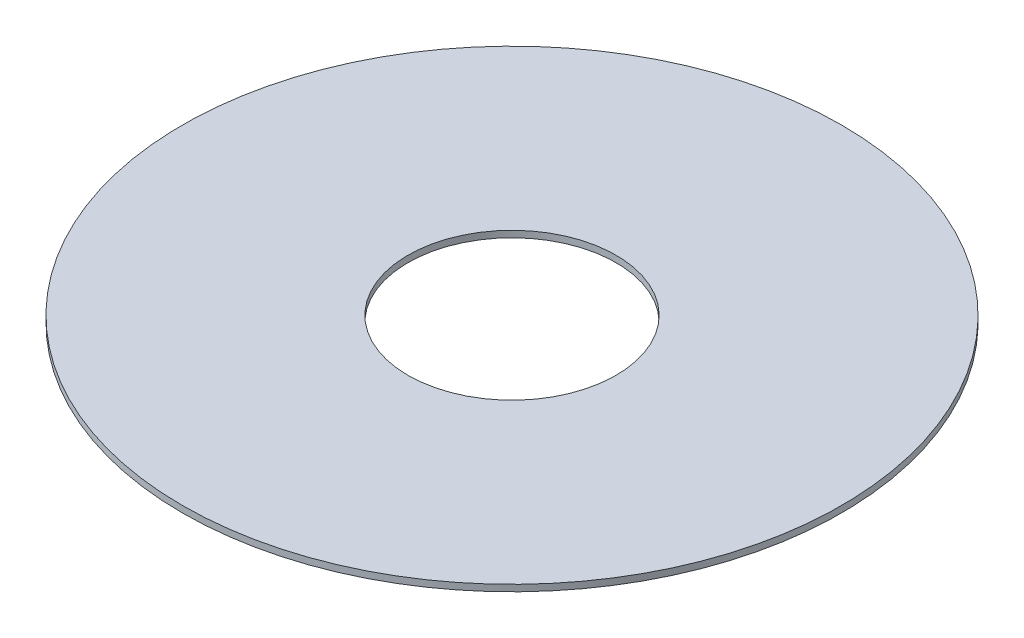
ISO-10303-21;
HEADER;
FILE_DESCRIPTION(('STEP AP214'),'2;1');
FILE_NAME('part.step','',(''),(''),'','','');
FILE_SCHEMA(('AUTOMOTIVE_DESIGN { 1 0 10303 214 1 1 1 1 }'));
ENDSEC;
DATA;
#1=APPLICATION_CONTEXT('core data for automotive mechanical design processes');
#2=APPLICATION_PROTOCOL_DEFINITION('international standard','automotive_design',2000,#1);
#3=PRODUCT_CONTEXT('',#1,'mechanical');
#4=PRODUCT('Part','Part','',(#3));
#5=PRODUCT_RELATED_PRODUCT_CATEGORY('part','',(#4));
#6=PRODUCT_DEFINITION_FORMATION('','',#4);
#7=PRODUCT_DEFINITION_CONTEXT('part definition',#1,'design');
#8=PRODUCT_DEFINITION('design','',#6,#7);
#9=PRODUCT_DEFINITION_SHAPE('','',#8);
#10=(LENGTH_UNIT() NAMED_UNIT(*) SI_UNIT(.MILLI.,.METRE.));
#11=(NAMED_UNIT(*) PLANE_ANGLE_UNIT() SI_UNIT($,.RADIAN.));
#12=(NAMED_UNIT(*) SI_UNIT($,.STERADIAN.) SOLID_ANGLE_UNIT());
#13=UNCERTAINTY_MEASURE_WITH_UNIT(LENGTH_MEASURE(1.E-05),#10,'distance_accuracy_value','');
#14=(GEOMETRIC_REPRESENTATION_CONTEXT(3) GLOBAL_UNCERTAINTY_ASSIGNED_CONTEXT((#13)) GLOBAL_UNIT_ASSIGNED_CONTEXT((#10,
#11,#12)) REPRESENTATION_CONTEXT('',''));
#15=CARTESIAN_POINT('',(0.,0.,0.));
#16=DIRECTION('',(0.,0.,1.));
#17=DIRECTION('',(1.,0.,0.));
#18=AXIS2_PLACEMENT_3D('',#15,#16,#17);
#19=CARTESIAN_POINT('',(0.,4.7625,0.));
#20=DIRECTION('',(0.,1.,0.));
#21=DIRECTION('',(0.,0.,1.));
#22=AXIS2_PLACEMENT_3D('',#19,#20,#21);
#23=PLANE('',#22);
#24=CARTESIAN_POINT('',(0.,4.7625,0.));
#25=DIRECTION('',(0.,1.,0.));
#26=DIRECTION('',(0.,0.,1.));
#27=AXIS2_PLACEMENT_3D('',#24,#25,#26);
#28=CIRCLE('',#27,241.3);
#29=CARTESIAN_POINT('',(0.,4.7625,241.3));
#30=VERTEX_POINT('',#29);
#31=EDGE_CURVE('E10',#30,#30,#28,.T.);
#32=ORIENTED_EDGE('',*,*,#31,.T.);
#33=EDGE_LOOP('',(#32));
#34=FACE_BOUND('',#33,.T.);
#35=CARTESIAN_POINT('',(0.,4.7625,0.));
#36=DIRECTION('',(0.,1.,0.));
#37=DIRECTION('',(0.,0.,1.));
#38=AXIS2_PLACEMENT_3D('',#35,#36,#37);
#39=CIRCLE('',#38,76.2);
#40=CARTESIAN_POINT('',(0.,4.7625,76.2));
#41=VERTEX_POINT('',#40);
#42=EDGE_CURVE('E39',#41,#41,#39,.T.);
#43=ORIENTED_EDGE('',*,*,#42,.F.);
#44=EDGE_LOOP('',(#43));
#45=FACE_BOUND('',#44,.T.);
#46=ADVANCED_FACE('F28',(#34,#45),#23,.T.);
#47=CARTESIAN_POINT('',(0.,0.,0.));
#48=DIRECTION('',(0.,1.,0.));
#49=DIRECTION('',(0.,0.,1.));
#50=AXIS2_PLACEMENT_3D('',#47,#48,#49);
#51=PLANE('',#50);
#52=CARTESIAN_POINT('',(0.,0.,0.));
#53=DIRECTION('',(0.,1.,0.));
#54=DIRECTION('',(0.,0.,1.));
#55=AXIS2_PLACEMENT_3D('',#52,#53,#54);
#56=CIRCLE('',#55,241.3);
#57=CARTESIAN_POINT('',(0.,0.,241.3));
#58=VERTEX_POINT('',#57);
#59=EDGE_CURVE('E32',#58,#58,#56,.T.);
#60=ORIENTED_EDGE('',*,*,#59,.F.);
#61=EDGE_LOOP('',(#60));
#62=FACE_BOUND('',#61,.T.);
#63=CARTESIAN_POINT('',(0.,0.,0.));
#64=DIRECTION('',(0.,1.,0.));
#65=DIRECTION('',(0.,0.,1.));
#66=AXIS2_PLACEMENT_3D('',#63,#64,#65);
#67=CIRCLE('',#66,76.2);
#68=CARTESIAN_POINT('',(0.,0.,76.2));
#69=VERTEX_POINT('',#68);
#70=EDGE_CURVE('E41',#69,#69,#67,.T.);
#71=ORIENTED_EDGE('',*,*,#70,.T.);
#72=EDGE_LOOP('',(#71));
#73=FACE_BOUND('',#72,.T.);
#74=ADVANCED_FACE('F51',(#62,#73),#51,.F.);
#75=CARTESIAN_POINT('',(0.,4.7625,0.));
#76=DIRECTION('',(0.,-1.,0.));
#77=DIRECTION('',(0.,0.,-1.));
#78=AXIS2_PLACEMENT_3D('',#75,#76,#77);
#79=CYLINDRICAL_SURFACE('',#78,241.3);
#80=ORIENTED_EDGE('',*,*,#31,.F.);
#81=EDGE_LOOP('',(#80));
#82=FACE_BOUND('',#81,.T.);
#83=ORIENTED_EDGE('',*,*,#59,.T.);
#84=EDGE_LOOP('',(#83));
#85=FACE_BOUND('',#84,.T.);
#86=ADVANCED_FACE('F30',(#82,#85),#79,.T.);
#87=CARTESIAN_POINT('',(0.,4.7625,0.));
#88=DIRECTION('',(0.,-1.,0.));
#89=DIRECTION('',(0.,0.,-1.));
#90=AXIS2_PLACEMENT_3D('',#87,#88,#89);
#91=CYLINDRICAL_SURFACE('',#90,76.2);
#92=ORIENTED_EDGE('',*,*,#42,.T.);
#93=EDGE_LOOP('',(#92));
#94=FACE_BOUND('',#93,.T.);
#95=ORIENTED_EDGE('',*,*,#70,.F.);
#96=EDGE_LOOP('',(#95));
#97=FACE_BOUND('',#96,.T.);
#98=ADVANCED_FACE('F47',(#94,#97),#91,.F.);
#99=CLOSED_SHELL('',(#46,#74,#86,#98));
#100=MANIFOLD_SOLID_BREP('B2',#99);
#101=ADVANCED_BREP_SHAPE_REPRESENTATION('',(#18,#100),#14);
#102=SHAPE_DEFINITION_REPRESENTATION(#9,#101);
ENDSEC;
END-ISO-10303-21;
